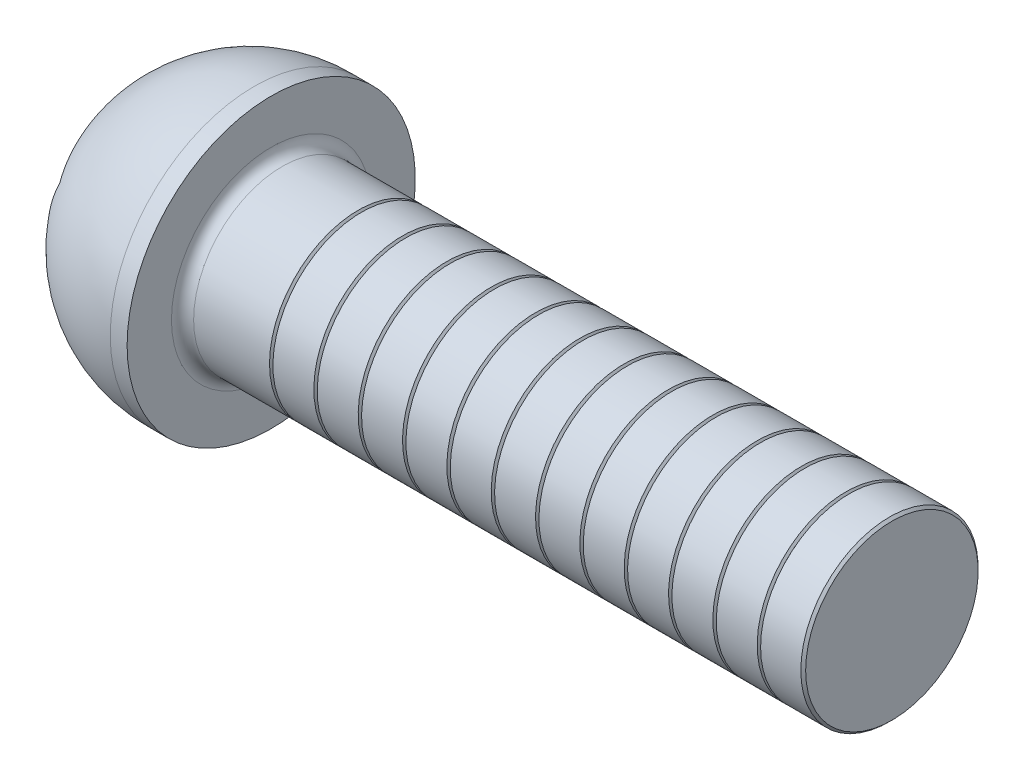
ISO-10303-21;
HEADER;
FILE_DESCRIPTION(('STEP AP214'),'2;1');
FILE_NAME('part.step','',(''),(''),'','','');
FILE_SCHEMA(('AUTOMOTIVE_DESIGN { 1 0 10303 214 1 1 1 1 }'));
ENDSEC;
DATA;
#1=APPLICATION_CONTEXT('core data for automotive mechanical design processes');
#2=APPLICATION_PROTOCOL_DEFINITION('international standard','automotive_design',2000,#1);
#3=PRODUCT_CONTEXT('',#1,'mechanical');
#4=PRODUCT('Part','Part','',(#3));
#5=PRODUCT_RELATED_PRODUCT_CATEGORY('part','',(#4));
#6=PRODUCT_DEFINITION_FORMATION('','',#4);
#7=PRODUCT_DEFINITION_CONTEXT('part definition',#1,'design');
#8=PRODUCT_DEFINITION('design','',#6,#7);
#9=PRODUCT_DEFINITION_SHAPE('','',#8);
#10=(LENGTH_UNIT() NAMED_UNIT(*) SI_UNIT(.MILLI.,.METRE.));
#11=(NAMED_UNIT(*) PLANE_ANGLE_UNIT() SI_UNIT($,.RADIAN.));
#12=(NAMED_UNIT(*) SI_UNIT($,.STERADIAN.) SOLID_ANGLE_UNIT());
#13=UNCERTAINTY_MEASURE_WITH_UNIT(LENGTH_MEASURE(1.E-05),#10,'distance_accuracy_value','');
#14=(GEOMETRIC_REPRESENTATION_CONTEXT(3) GLOBAL_UNCERTAINTY_ASSIGNED_CONTEXT((#13)) GLOBAL_UNIT_ASSIGNED_CONTEXT((#10,
#11,#12)) REPRESENTATION_CONTEXT('',''));
#15=CARTESIAN_POINT('',(0.,0.,0.));
#16=DIRECTION('',(0.,0.,1.));
#17=DIRECTION('',(1.,0.,0.));
#18=AXIS2_PLACEMENT_3D('',#15,#16,#17);
#19=CARTESIAN_POINT('',(2.81648544520552,0.,0.));
#20=DIRECTION('',(-1.,0.,0.));
#21=DIRECTION('',(0.,1.,0.));
#22=AXIS2_PLACEMENT_3D('',#19,#20,#21);
#23=SPHERICAL_SURFACE('',#22,3.25164808413431);
#24=CARTESIAN_POINT('',(2.92000000000003,0.,0.));
#25=DIRECTION('',(-1.,0.,0.));
#26=DIRECTION('',(0.,0.,1.));
#27=AXIS2_PLACEMENT_3D('',#24,#25,#26);
#28=CIRCLE('',#27,3.25);
#29=CARTESIAN_POINT('',(2.92000000000003,0.,3.25));
#30=VERTEX_POINT('',#29);
#31=EDGE_CURVE('E181',#30,#30,#28,.T.);
#32=ORIENTED_EDGE('',*,*,#31,.T.);
#33=EDGE_LOOP('',(#32));
#34=FACE_BOUND('',#33,.T.);
#35=CARTESIAN_POINT('',(2.81648544520552,-1.73205080756889,-0.99999999999989));
#36=DIRECTION('',(0.,0.866025403784439,0.500000000000001));
#37=DIRECTION('',(0.,-0.499999999999999,0.866025403784439));
#38=AXIS2_PLACEMENT_3D('',#35,#36,#37);
#39=CIRCLE('',#38,2.56382824367279);
#40=CARTESIAN_POINT('',(0.527406606519287,-2.30940107675837,3.33066907387547E-13));
#41=VERTEX_POINT('',#40);
#42=CARTESIAN_POINT('',(0.527406606519287,-1.15470053837918,-1.99999999999972));
#43=VERTEX_POINT('',#42);
#44=EDGE_CURVE('E145',#41,#43,#39,.F.);
#45=ORIENTED_EDGE('',*,*,#44,.T.);
#46=CARTESIAN_POINT('',(2.81648544520552,0.,-1.99999999999989));
#47=DIRECTION('',(0.,0.,1.));
#48=DIRECTION('',(0.,-1.,0.));
#49=AXIS2_PLACEMENT_3D('',#46,#47,#48);
#50=CIRCLE('',#49,2.56382824367279);
#51=CARTESIAN_POINT('',(0.527406606519287,1.15470053837941,-1.99999999999967));
#52=VERTEX_POINT('',#51);
#53=EDGE_CURVE('E161',#43,#52,#50,.F.);
#54=ORIENTED_EDGE('',*,*,#53,.T.);
#55=CARTESIAN_POINT('',(2.81648544520552,1.73205080756889,-0.99999999999989));
#56=DIRECTION('',(0.,-0.866025403784438,0.5));
#57=DIRECTION('',(0.,-0.500000000000001,-0.86602540378444));
#58=AXIS2_PLACEMENT_3D('',#55,#56,#57);
#59=CIRCLE('',#58,2.56382824367279);
#60=CARTESIAN_POINT('',(0.527406606519287,2.30940107675848,0.));
#61=VERTEX_POINT('',#60);
#62=EDGE_CURVE('E158',#52,#61,#59,.F.);
#63=ORIENTED_EDGE('',*,*,#62,.T.);
#64=CARTESIAN_POINT('',(2.81648544520552,1.73205080756889,1.00000000000028));
#65=DIRECTION('',(0.,-0.866025403784439,-0.500000000000001));
#66=DIRECTION('',(0.,0.5,-0.866025403784439));
#67=AXIS2_PLACEMENT_3D('',#64,#65,#66);
#68=CIRCLE('',#67,2.56382824367279);
#69=CARTESIAN_POINT('',(0.527406606519287,1.15470053837929,2.00000000000006));
#70=VERTEX_POINT('',#69);
#71=EDGE_CURVE('E150',#61,#70,#68,.F.);
#72=ORIENTED_EDGE('',*,*,#71,.T.);
#73=CARTESIAN_POINT('',(2.81648544520552,0.,2.));
#74=DIRECTION('',(0.,0.,-1.));
#75=DIRECTION('',(0.,1.,0.));
#76=AXIS2_PLACEMENT_3D('',#73,#74,#75);
#77=CIRCLE('',#76,2.56382824367279);
#78=CARTESIAN_POINT('',(0.527406606519287,-1.15470053837918,2.00000000000033));
#79=VERTEX_POINT('',#78);
#80=EDGE_CURVE('E146',#70,#79,#77,.F.);
#81=ORIENTED_EDGE('',*,*,#80,.T.);
#82=CARTESIAN_POINT('',(2.81648544520552,-1.73205080756889,1.00000000000028));
#83=DIRECTION('',(0.,0.866025403784439,-0.5));
#84=DIRECTION('',(0.,0.500000000000001,0.866025403784439));
#85=AXIS2_PLACEMENT_3D('',#82,#83,#84);
#86=CIRCLE('',#85,2.56382824367279);
#87=EDGE_CURVE('E165',#79,#41,#86,.F.);
#88=ORIENTED_EDGE('',*,*,#87,.T.);
#89=EDGE_LOOP('',(#45,#54,#63,#72,#81,#88));
#90=FACE_BOUND('',#89,.T.);
#91=ADVANCED_FACE('F51',(#34,#90),#23,.T.);
#92=CARTESIAN_POINT('',(0.,0.,0.));
#93=DIRECTION('',(-1.,0.,0.));
#94=DIRECTION('',(0.,0.,1.));
#95=AXIS2_PLACEMENT_3D('',#92,#93,#94);
#96=CYLINDRICAL_SURFACE('',#95,3.25);
#97=ORIENTED_EDGE('',*,*,#31,.F.);
#98=EDGE_LOOP('',(#97));
#99=FACE_BOUND('',#98,.T.);
#100=CARTESIAN_POINT('',(3.29999999999997,0.,0.));
#101=DIRECTION('',(-1.,0.,0.));
#102=DIRECTION('',(0.,0.,1.));
#103=AXIS2_PLACEMENT_3D('',#100,#101,#102);
#104=CIRCLE('',#103,3.25);
#105=CARTESIAN_POINT('',(3.29999999999997,0.,3.25));
#106=VERTEX_POINT('',#105);
#107=EDGE_CURVE('E178',#106,#106,#104,.T.);
#108=ORIENTED_EDGE('',*,*,#107,.T.);
#109=EDGE_LOOP('',(#108));
#110=FACE_BOUND('',#109,.T.);
#111=ADVANCED_FACE('F203',(#99,#110),#96,.T.);
#112=CARTESIAN_POINT('',(3.29999999999997,2.,0.));
#113=DIRECTION('',(-1.,0.,0.));
#114=DIRECTION('',(0.,0.,1.));
#115=AXIS2_PLACEMENT_3D('',#112,#113,#114);
#116=PLANE('',#115);
#117=CARTESIAN_POINT('',(3.29999999999997,0.,0.));
#118=DIRECTION('',(-1.,0.,0.));
#119=DIRECTION('',(0.,0.,1.));
#120=AXIS2_PLACEMENT_3D('',#117,#118,#119);
#121=CIRCLE('',#120,2.25);
#122=CARTESIAN_POINT('',(3.29999999999997,0.,2.25));
#123=VERTEX_POINT('',#122);
#124=EDGE_CURVE('E59',#123,#123,#121,.T.);
#125=ORIENTED_EDGE('',*,*,#124,.T.);
#126=EDGE_LOOP('',(#125));
#127=FACE_BOUND('',#126,.T.);
#128=ORIENTED_EDGE('',*,*,#107,.F.);
#129=EDGE_LOOP('',(#128));
#130=FACE_BOUND('',#129,.T.);
#131=ADVANCED_FACE('F186',(#127,#130),#116,.F.);
#132=CARTESIAN_POINT('',(0.,0.,0.));
#133=DIRECTION('',(-1.,0.,0.));
#134=DIRECTION('',(0.,0.,1.));
#135=AXIS2_PLACEMENT_3D('',#132,#133,#134);
#136=CYLINDRICAL_SURFACE('',#135,2.);
#137=CARTESIAN_POINT('',(5.26183868916752,0.,0.));
#138=DIRECTION('',(-1.,0.,0.));
#139=DIRECTION('',(0.,-1.,0.));
#140=AXIS2_PLACEMENT_3D('',#137,#138,#139);
#141=CIRCLE('',#140,2.);
#142=CARTESIAN_POINT('',(5.26183868916752,-2.,0.));
#143=VERTEX_POINT('',#142);
#144=EDGE_CURVE('E462',#143,#143,#141,.T.);
#145=ORIENTED_EDGE('',*,*,#144,.T.);
#146=EDGE_LOOP('',(#145));
#147=FACE_BOUND('',#146,.T.);
#148=CARTESIAN_POINT('',(3.55000000000005,0.,0.));
#149=DIRECTION('',(-1.,0.,0.));
#150=DIRECTION('',(0.,0.,1.));
#151=AXIS2_PLACEMENT_3D('',#148,#149,#150);
#152=CIRCLE('',#151,2.);
#153=CARTESIAN_POINT('',(3.55000000000005,0.,2.));
#154=VERTEX_POINT('',#153);
#155=EDGE_CURVE('E13',#154,#154,#152,.F.);
#156=ORIENTED_EDGE('',*,*,#155,.T.);
#157=EDGE_LOOP('',(#156));
#158=FACE_BOUND('',#157,.T.);
#159=ADVANCED_FACE('F190',(#147,#158),#136,.T.);
#160=CARTESIAN_POINT('',(3.55000000000005,0.,0.));
#161=DIRECTION('',(-1.,0.,0.));
#162=DIRECTION('',(0.,0.,1.));
#163=AXIS2_PLACEMENT_3D('',#160,#161,#162);
#164=TOROIDAL_SURFACE('',#163,2.25,0.25);
#165=ORIENTED_EDGE('',*,*,#155,.F.);
#166=EDGE_LOOP('',(#165));
#167=FACE_BOUND('',#166,.T.);
#168=ORIENTED_EDGE('',*,*,#124,.F.);
#169=EDGE_LOOP('',(#168));
#170=FACE_BOUND('',#169,.T.);
#171=ADVANCED_FACE('F53',(#167,#170),#164,.F.);
#172=CARTESIAN_POINT('',(2.07999999999997,-2.30940107675837,3.33066907387547E-13));
#173=DIRECTION('',(0.,0.866025403784439,-0.5));
#174=DIRECTION('',(0.,0.500000000000001,0.866025403784439));
#175=AXIS2_PLACEMENT_3D('',#172,#173,#174);
#176=PLANE('',#175);
#177=ORIENTED_EDGE('',*,*,#87,.F.);
#178=DIRECTION('',(-1.,0.,0.));
#179=VECTOR('',#178,1.);
#180=CARTESIAN_POINT('',(2.07999999999997,-1.15470053837918,2.00000000000033));
#181=LINE('',#180,#179);
#182=CARTESIAN_POINT('',(2.07999999999997,-1.15470053837918,2.00000000000033));
#183=VERTEX_POINT('',#182);
#184=EDGE_CURVE('E482',#183,#79,#181,.T.);
#185=ORIENTED_EDGE('',*,*,#184,.F.);
#186=DIRECTION('',(0.,-0.500000000000001,-0.866025403784439));
#187=VECTOR('',#186,1.);
#188=CARTESIAN_POINT('',(2.07999999999997,-2.30940107675837,3.33066907387547E-13));
#189=LINE('',#188,#187);
#190=CARTESIAN_POINT('',(2.07999999999997,-1.73205080756889,1.00000000000028));
#191=VERTEX_POINT('',#190);
#192=EDGE_CURVE('E130',#183,#191,#189,.T.);
#193=ORIENTED_EDGE('',*,*,#192,.T.);
#194=CARTESIAN_POINT('',(2.07999999999997,-2.30940107675837,3.33066907387547E-13));
#195=VERTEX_POINT('',#194);
#196=EDGE_CURVE('E124',#191,#195,#189,.T.);
#197=ORIENTED_EDGE('',*,*,#196,.T.);
#198=DIRECTION('',(-1.,0.,0.));
#199=VECTOR('',#198,1.);
#200=CARTESIAN_POINT('',(2.07999999999997,-2.30940107675837,3.33066907387547E-13));
#201=LINE('',#200,#199);
#202=EDGE_CURVE('E126',#195,#41,#201,.T.);
#203=ORIENTED_EDGE('',*,*,#202,.T.);
#204=EDGE_LOOP('',(#177,#185,#193,#197,#203));
#205=FACE_BOUND('',#204,.T.);
#206=ADVANCED_FACE('F125',(#205),#176,.T.);
#207=CARTESIAN_POINT('',(2.07999999999997,-1.15470053837918,-1.99999999999972));
#208=DIRECTION('',(0.,0.866025403784439,0.500000000000001));
#209=DIRECTION('',(0.,-0.499999999999999,0.866025403784439));
#210=AXIS2_PLACEMENT_3D('',#207,#208,#209);
#211=PLANE('',#210);
#212=ORIENTED_EDGE('',*,*,#44,.F.);
#213=ORIENTED_EDGE('',*,*,#202,.F.);
#214=DIRECTION('',(0.,0.499999999999999,-0.866025403784439));
#215=VECTOR('',#214,1.);
#216=CARTESIAN_POINT('',(2.07999999999997,-1.15470053837918,-1.99999999999972));
#217=LINE('',#216,#215);
#218=CARTESIAN_POINT('',(2.07999999999997,-1.73205080756889,-0.99999999999989));
#219=VERTEX_POINT('',#218);
#220=EDGE_CURVE('E66',#195,#219,#217,.T.);
#221=ORIENTED_EDGE('',*,*,#220,.T.);
#222=CARTESIAN_POINT('',(2.07999999999997,-1.15470053837918,-1.99999999999972));
#223=VERTEX_POINT('',#222);
#224=EDGE_CURVE('E140',#219,#223,#217,.T.);
#225=ORIENTED_EDGE('',*,*,#224,.T.);
#226=DIRECTION('',(-1.,0.,0.));
#227=VECTOR('',#226,1.);
#228=CARTESIAN_POINT('',(2.07999999999997,-1.15470053837918,-1.99999999999972));
#229=LINE('',#228,#227);
#230=EDGE_CURVE('E147',#223,#43,#229,.T.);
#231=ORIENTED_EDGE('',*,*,#230,.T.);
#232=EDGE_LOOP('',(#212,#213,#221,#225,#231));
#233=FACE_BOUND('',#232,.T.);
#234=ADVANCED_FACE('F142',(#233),#211,.T.);
#235=CARTESIAN_POINT('',(2.07999999999997,1.15470053837941,-1.99999999999967));
#236=DIRECTION('',(0.,0.,1.));
#237=DIRECTION('',(0.,-1.,0.));
#238=AXIS2_PLACEMENT_3D('',#235,#236,#237);
#239=PLANE('',#238);
#240=ORIENTED_EDGE('',*,*,#53,.F.);
#241=ORIENTED_EDGE('',*,*,#230,.F.);
#242=DIRECTION('',(0.,1.,0.));
#243=VECTOR('',#242,1.);
#244=CARTESIAN_POINT('',(2.07999999999997,1.15470053837941,-1.99999999999967));
#245=LINE('',#244,#243);
#246=CARTESIAN_POINT('',(2.07999999999997,0.,-1.99999999999989));
#247=VERTEX_POINT('',#246);
#248=EDGE_CURVE('E467',#223,#247,#245,.T.);
#249=ORIENTED_EDGE('',*,*,#248,.T.);
#250=CARTESIAN_POINT('',(2.07999999999997,1.15470053837941,-1.99999999999967));
#251=VERTEX_POINT('',#250);
#252=EDGE_CURVE('E139',#247,#251,#245,.T.);
#253=ORIENTED_EDGE('',*,*,#252,.T.);
#254=DIRECTION('',(-1.,0.,0.));
#255=VECTOR('',#254,1.);
#256=CARTESIAN_POINT('',(2.07999999999997,1.15470053837941,-1.99999999999967));
#257=LINE('',#256,#255);
#258=EDGE_CURVE('E152',#251,#52,#257,.T.);
#259=ORIENTED_EDGE('',*,*,#258,.T.);
#260=EDGE_LOOP('',(#240,#241,#249,#253,#259));
#261=FACE_BOUND('',#260,.T.);
#262=ADVANCED_FACE('F231',(#261),#239,.T.);
#263=CARTESIAN_POINT('',(2.07999999999997,2.30940107675848,0.));
#264=DIRECTION('',(0.,-0.866025403784438,0.5));
#265=DIRECTION('',(0.,-0.500000000000001,-0.86602540378444));
#266=AXIS2_PLACEMENT_3D('',#263,#264,#265);
#267=PLANE('',#266);
#268=ORIENTED_EDGE('',*,*,#62,.F.);
#269=ORIENTED_EDGE('',*,*,#258,.F.);
#270=DIRECTION('',(0.,0.500000000000001,0.866025403784439));
#271=VECTOR('',#270,1.);
#272=CARTESIAN_POINT('',(2.07999999999997,2.30940107675848,0.));
#273=LINE('',#272,#271);
#274=CARTESIAN_POINT('',(2.07999999999997,1.73205080756889,-0.99999999999989));
#275=VERTEX_POINT('',#274);
#276=EDGE_CURVE('E471',#251,#275,#273,.T.);
#277=ORIENTED_EDGE('',*,*,#276,.T.);
#278=CARTESIAN_POINT('',(2.07999999999997,2.30940107675848,0.));
#279=VERTEX_POINT('',#278);
#280=EDGE_CURVE('E470',#275,#279,#273,.T.);
#281=ORIENTED_EDGE('',*,*,#280,.T.);
#282=DIRECTION('',(-1.,0.,0.));
#283=VECTOR('',#282,1.);
#284=CARTESIAN_POINT('',(2.07999999999997,2.30940107675848,0.));
#285=LINE('',#284,#283);
#286=EDGE_CURVE('E488',#279,#61,#285,.T.);
#287=ORIENTED_EDGE('',*,*,#286,.T.);
#288=EDGE_LOOP('',(#268,#269,#277,#281,#287));
#289=FACE_BOUND('',#288,.T.);
#290=ADVANCED_FACE('F234',(#289),#267,.T.);
#291=CARTESIAN_POINT('',(2.07999999999997,1.15470053837929,2.00000000000006));
#292=DIRECTION('',(0.,-0.866025403784439,-0.500000000000001));
#293=DIRECTION('',(0.,0.5,-0.866025403784439));
#294=AXIS2_PLACEMENT_3D('',#291,#292,#293);
#295=PLANE('',#294);
#296=ORIENTED_EDGE('',*,*,#71,.F.);
#297=ORIENTED_EDGE('',*,*,#286,.F.);
#298=DIRECTION('',(0.,-0.5,0.866025403784439));
#299=VECTOR('',#298,1.);
#300=CARTESIAN_POINT('',(2.07999999999997,1.15470053837929,2.00000000000006));
#301=LINE('',#300,#299);
#302=CARTESIAN_POINT('',(2.07999999999997,1.73205080756889,1.00000000000028));
#303=VERTEX_POINT('',#302);
#304=EDGE_CURVE('E475',#279,#303,#301,.T.);
#305=ORIENTED_EDGE('',*,*,#304,.T.);
#306=CARTESIAN_POINT('',(2.07999999999997,1.15470053837929,2.00000000000006));
#307=VERTEX_POINT('',#306);
#308=EDGE_CURVE('E474',#303,#307,#301,.T.);
#309=ORIENTED_EDGE('',*,*,#308,.T.);
#310=DIRECTION('',(-1.,0.,0.));
#311=VECTOR('',#310,1.);
#312=CARTESIAN_POINT('',(2.07999999999997,1.15470053837929,2.00000000000006));
#313=LINE('',#312,#311);
#314=EDGE_CURVE('E485',#307,#70,#313,.T.);
#315=ORIENTED_EDGE('',*,*,#314,.T.);
#316=EDGE_LOOP('',(#296,#297,#305,#309,#315));
#317=FACE_BOUND('',#316,.T.);
#318=ADVANCED_FACE('F238',(#317),#295,.T.);
#319=CARTESIAN_POINT('',(2.07999999999997,-1.15470053837918,2.00000000000033));
#320=DIRECTION('',(0.,0.,-1.));
#321=DIRECTION('',(0.,1.,0.));
#322=AXIS2_PLACEMENT_3D('',#319,#320,#321);
#323=PLANE('',#322);
#324=ORIENTED_EDGE('',*,*,#80,.F.);
#325=ORIENTED_EDGE('',*,*,#314,.F.);
#326=DIRECTION('',(0.,-1.,0.));
#327=VECTOR('',#326,1.);
#328=CARTESIAN_POINT('',(2.07999999999997,-1.15470053837918,2.00000000000033));
#329=LINE('',#328,#327);
#330=CARTESIAN_POINT('',(2.07999999999997,0.,2.));
#331=VERTEX_POINT('',#330);
#332=EDGE_CURVE('E479',#307,#331,#329,.T.);
#333=ORIENTED_EDGE('',*,*,#332,.T.);
#334=EDGE_CURVE('E478',#331,#183,#329,.T.);
#335=ORIENTED_EDGE('',*,*,#334,.T.);
#336=ORIENTED_EDGE('',*,*,#184,.T.);
#337=EDGE_LOOP('',(#324,#325,#333,#335,#336));
#338=FACE_BOUND('',#337,.T.);
#339=ADVANCED_FACE('F242',(#338),#323,.T.);
#340=CARTESIAN_POINT('',(2.07999999999997,-3.46410161513777,-1.99999999999972));
#341=DIRECTION('',(1.,0.,0.));
#342=DIRECTION('',(0.,0.,-1.));
#343=AXIS2_PLACEMENT_3D('',#340,#341,#342);
#344=PLANE('',#343);
#345=CARTESIAN_POINT('',(2.07999999999997,0.,0.));
#346=DIRECTION('',(-1.,0.,0.));
#347=DIRECTION('',(0.,0.,1.));
#348=AXIS2_PLACEMENT_3D('',#345,#346,#347);
#349=CIRCLE('',#348,2.);
#350=EDGE_CURVE('E502',#275,#247,#349,.T.);
#351=ORIENTED_EDGE('',*,*,#350,.F.);
#352=ORIENTED_EDGE('',*,*,#276,.F.);
#353=ORIENTED_EDGE('',*,*,#252,.F.);
#354=EDGE_LOOP('',(#351,#352,#353));
#355=FACE_BOUND('',#354,.T.);
#356=ADVANCED_FACE('F246',(#355),#344,.F.);
#357=EDGE_CURVE('E172',#303,#275,#349,.T.);
#358=ORIENTED_EDGE('',*,*,#357,.F.);
#359=ORIENTED_EDGE('',*,*,#304,.F.);
#360=ORIENTED_EDGE('',*,*,#280,.F.);
#361=EDGE_LOOP('',(#358,#359,#360));
#362=FACE_BOUND('',#361,.T.);
#363=ADVANCED_FACE('F509',(#362),#344,.F.);
#364=EDGE_CURVE('E168',#331,#303,#349,.T.);
#365=ORIENTED_EDGE('',*,*,#364,.F.);
#366=ORIENTED_EDGE('',*,*,#332,.F.);
#367=ORIENTED_EDGE('',*,*,#308,.F.);
#368=EDGE_LOOP('',(#365,#366,#367));
#369=FACE_BOUND('',#368,.T.);
#370=ADVANCED_FACE('F511',(#369),#344,.F.);
#371=EDGE_CURVE('E167',#191,#331,#349,.T.);
#372=ORIENTED_EDGE('',*,*,#371,.F.);
#373=ORIENTED_EDGE('',*,*,#192,.F.);
#374=ORIENTED_EDGE('',*,*,#334,.F.);
#375=EDGE_LOOP('',(#372,#373,#374));
#376=FACE_BOUND('',#375,.T.);
#377=ADVANCED_FACE('F500',(#376),#344,.F.);
#378=EDGE_CURVE('E137',#219,#191,#349,.T.);
#379=ORIENTED_EDGE('',*,*,#378,.F.);
#380=ORIENTED_EDGE('',*,*,#220,.F.);
#381=ORIENTED_EDGE('',*,*,#196,.F.);
#382=EDGE_LOOP('',(#379,#380,#381));
#383=FACE_BOUND('',#382,.T.);
#384=ADVANCED_FACE('F136',(#383),#344,.F.);
#385=EDGE_CURVE('E501',#247,#219,#349,.T.);
#386=ORIENTED_EDGE('',*,*,#385,.F.);
#387=ORIENTED_EDGE('',*,*,#248,.F.);
#388=ORIENTED_EDGE('',*,*,#224,.F.);
#389=EDGE_LOOP('',(#386,#387,#388));
#390=FACE_BOUND('',#389,.T.);
#391=ADVANCED_FACE('F226',(#390),#344,.F.);
#392=CARTESIAN_POINT('',(3.23470053837926,0.,0.));
#393=DIRECTION('',(-1.,0.,0.));
#394=DIRECTION('',(0.,0.,1.));
#395=AXIS2_PLACEMENT_3D('',#392,#393,#394);
#396=CONICAL_SURFACE('',#395,0.,1.04719755119659);
#397=ORIENTED_EDGE('',*,*,#364,.T.);
#398=ORIENTED_EDGE('',*,*,#357,.T.);
#399=ORIENTED_EDGE('',*,*,#350,.T.);
#400=ORIENTED_EDGE('',*,*,#385,.T.);
#401=ORIENTED_EDGE('',*,*,#378,.T.);
#402=ORIENTED_EDGE('',*,*,#371,.T.);
#403=EDGE_LOOP('',(#397,#398,#399,#400,#401,#402));
#404=FACE_BOUND('',#403,.T.);
#405=CARTESIAN_POINT('',(3.23470053837926,0.,0.));
#406=VERTEX_POINT('',#405);
#407=VERTEX_LOOP('',#406);
#408=FACE_BOUND('',#407,.T.);
#409=ADVANCED_FACE('F223',(#404,#408),#396,.F.);
#410=CARTESIAN_POINT('',(5.33816131083242,0.,0.));
#411=DIRECTION('',(1.,0.,0.));
#412=DIRECTION('',(0.,1.,0.));
#413=AXIS2_PLACEMENT_3D('',#410,#411,#412);
#414=CONICAL_SURFACE('',#413,2.,0.959931088596876);
#415=CARTESIAN_POINT('',(5.29999999999997,0.,0.));
#416=DIRECTION('',(-1.,0.,0.));
#417=DIRECTION('',(0.,-1.,0.));
#418=AXIS2_PLACEMENT_3D('',#415,#416,#417);
#419=CIRCLE('',#418,1.9455);
#420=CARTESIAN_POINT('',(5.29999999999997,-1.9455,0.));
#421=VERTEX_POINT('',#420);
#422=EDGE_CURVE('E459',#421,#421,#419,.T.);
#423=ORIENTED_EDGE('',*,*,#422,.F.);
#424=EDGE_LOOP('',(#423));
#425=FACE_BOUND('',#424,.T.);
#426=CARTESIAN_POINT('',(5.33816131083242,0.,0.));
#427=DIRECTION('',(-1.,0.,0.));
#428=DIRECTION('',(0.,-1.,0.));
#429=AXIS2_PLACEMENT_3D('',#426,#427,#428);
#430=CIRCLE('',#429,2.);
#431=CARTESIAN_POINT('',(5.33816131083242,-2.,0.));
#432=VERTEX_POINT('',#431);
#433=EDGE_CURVE('E134',#432,#432,#430,.T.);
#434=ORIENTED_EDGE('',*,*,#433,.T.);
#435=EDGE_LOOP('',(#434));
#436=FACE_BOUND('',#435,.T.);
#437=ADVANCED_FACE('F225',(#425,#436),#414,.T.);
#438=CARTESIAN_POINT('',(5.29999999999997,0.,0.));
#439=DIRECTION('',(-1.,0.,0.));
#440=DIRECTION('',(0.,-1.,0.));
#441=AXIS2_PLACEMENT_3D('',#438,#439,#440);
#442=CONICAL_SURFACE('',#441,1.9455,0.959931088596898);
#443=ORIENTED_EDGE('',*,*,#144,.F.);
#444=EDGE_LOOP('',(#443));
#445=FACE_BOUND('',#444,.T.);
#446=ORIENTED_EDGE('',*,*,#422,.T.);
#447=EDGE_LOOP('',(#446));
#448=FACE_BOUND('',#447,.T.);
#449=ADVANCED_FACE('F253',(#445,#448),#442,.T.);
#450=CARTESIAN_POINT('',(6.26183868916752,0.,0.));
#451=DIRECTION('',(-1.,0.,0.));
#452=DIRECTION('',(0.,-1.,0.));
#453=AXIS2_PLACEMENT_3D('',#450,#451,#452);
#454=CIRCLE('',#453,2.);
#455=CARTESIAN_POINT('',(6.26183868916752,-2.,0.));
#456=VERTEX_POINT('',#455);
#457=EDGE_CURVE('E453',#456,#456,#454,.T.);
#458=ORIENTED_EDGE('',*,*,#457,.T.);
#459=EDGE_LOOP('',(#458));
#460=FACE_BOUND('',#459,.T.);
#461=ORIENTED_EDGE('',*,*,#433,.F.);
#462=EDGE_LOOP('',(#461));
#463=FACE_BOUND('',#462,.T.);
#464=ADVANCED_FACE('F200',(#460,#463),#136,.T.);
#465=CARTESIAN_POINT('',(6.33816131083242,0.,0.));
#466=DIRECTION('',(1.,0.,0.));
#467=DIRECTION('',(0.,1.,0.));
#468=AXIS2_PLACEMENT_3D('',#465,#466,#467);
#469=CONICAL_SURFACE('',#468,2.,0.959931088596876);
#470=CARTESIAN_POINT('',(6.29999999999997,0.,0.));
#471=DIRECTION('',(-1.,0.,0.));
#472=DIRECTION('',(0.,-1.,0.));
#473=AXIS2_PLACEMENT_3D('',#470,#471,#472);
#474=CIRCLE('',#473,1.9455);
#475=CARTESIAN_POINT('',(6.29999999999997,-1.9455,0.));
#476=VERTEX_POINT('',#475);
#477=EDGE_CURVE('E450',#476,#476,#474,.T.);
#478=ORIENTED_EDGE('',*,*,#477,.F.);
#479=EDGE_LOOP('',(#478));
#480=FACE_BOUND('',#479,.T.);
#481=CARTESIAN_POINT('',(6.33816131083242,0.,0.));
#482=DIRECTION('',(-1.,0.,0.));
#483=DIRECTION('',(0.,-1.,0.));
#484=AXIS2_PLACEMENT_3D('',#481,#482,#483);
#485=CIRCLE('',#484,2.);
#486=CARTESIAN_POINT('',(6.33816131083242,-2.,0.));
#487=VERTEX_POINT('',#486);
#488=EDGE_CURVE('E456',#487,#487,#485,.T.);
#489=ORIENTED_EDGE('',*,*,#488,.T.);
#490=EDGE_LOOP('',(#489));
#491=FACE_BOUND('',#490,.T.);
#492=ADVANCED_FACE('F258',(#480,#491),#469,.T.);
#493=CARTESIAN_POINT('',(6.29999999999997,0.,0.));
#494=DIRECTION('',(-1.,0.,0.));
#495=DIRECTION('',(0.,-1.,0.));
#496=AXIS2_PLACEMENT_3D('',#493,#494,#495);
#497=CONICAL_SURFACE('',#496,1.9455,0.959931088596898);
#498=ORIENTED_EDGE('',*,*,#457,.F.);
#499=EDGE_LOOP('',(#498));
#500=FACE_BOUND('',#499,.T.);
#501=ORIENTED_EDGE('',*,*,#477,.T.);
#502=EDGE_LOOP('',(#501));
#503=FACE_BOUND('',#502,.T.);
#504=ADVANCED_FACE('F261',(#500,#503),#497,.T.);
#505=CARTESIAN_POINT('',(7.26183868916752,0.,0.));
#506=DIRECTION('',(-1.,0.,0.));
#507=DIRECTION('',(0.,-1.,0.));
#508=AXIS2_PLACEMENT_3D('',#505,#506,#507);
#509=CIRCLE('',#508,2.);
#510=CARTESIAN_POINT('',(7.26183868916752,-2.,0.));
#511=VERTEX_POINT('',#510);
#512=EDGE_CURVE('E444',#511,#511,#509,.T.);
#513=ORIENTED_EDGE('',*,*,#512,.T.);
#514=EDGE_LOOP('',(#513));
#515=FACE_BOUND('',#514,.T.);
#516=ORIENTED_EDGE('',*,*,#488,.F.);
#517=EDGE_LOOP('',(#516));
#518=FACE_BOUND('',#517,.T.);
#519=ADVANCED_FACE('F265',(#515,#518),#136,.T.);
#520=CARTESIAN_POINT('',(7.33816131083243,0.,0.));
#521=DIRECTION('',(1.,0.,0.));
#522=DIRECTION('',(0.,1.,0.));
#523=AXIS2_PLACEMENT_3D('',#520,#521,#522);
#524=CONICAL_SURFACE('',#523,2.,0.959931088596876);
#525=CARTESIAN_POINT('',(7.29999999999997,0.,0.));
#526=DIRECTION('',(-1.,0.,0.));
#527=DIRECTION('',(0.,-1.,0.));
#528=AXIS2_PLACEMENT_3D('',#525,#526,#527);
#529=CIRCLE('',#528,1.9455);
#530=CARTESIAN_POINT('',(7.29999999999997,-1.9455,0.));
#531=VERTEX_POINT('',#530);
#532=EDGE_CURVE('E441',#531,#531,#529,.T.);
#533=ORIENTED_EDGE('',*,*,#532,.F.);
#534=EDGE_LOOP('',(#533));
#535=FACE_BOUND('',#534,.T.);
#536=CARTESIAN_POINT('',(7.33816131083243,0.,0.));
#537=DIRECTION('',(-1.,0.,0.));
#538=DIRECTION('',(0.,-1.,0.));
#539=AXIS2_PLACEMENT_3D('',#536,#537,#538);
#540=CIRCLE('',#539,2.);
#541=CARTESIAN_POINT('',(7.33816131083243,-2.,0.));
#542=VERTEX_POINT('',#541);
#543=EDGE_CURVE('E447',#542,#542,#540,.T.);
#544=ORIENTED_EDGE('',*,*,#543,.T.);
#545=EDGE_LOOP('',(#544));
#546=FACE_BOUND('',#545,.T.);
#547=ADVANCED_FACE('F267',(#535,#546),#524,.T.);
#548=CARTESIAN_POINT('',(7.29999999999997,0.,0.));
#549=DIRECTION('',(-1.,0.,0.));
#550=DIRECTION('',(0.,-1.,0.));
#551=AXIS2_PLACEMENT_3D('',#548,#549,#550);
#552=CONICAL_SURFACE('',#551,1.9455,0.959931088596898);
#553=ORIENTED_EDGE('',*,*,#512,.F.);
#554=EDGE_LOOP('',(#553));
#555=FACE_BOUND('',#554,.T.);
#556=ORIENTED_EDGE('',*,*,#532,.T.);
#557=EDGE_LOOP('',(#556));
#558=FACE_BOUND('',#557,.T.);
#559=ADVANCED_FACE('F270',(#555,#558),#552,.T.);
#560=CARTESIAN_POINT('',(8.26183868916752,0.,0.));
#561=DIRECTION('',(-1.,0.,0.));
#562=DIRECTION('',(0.,-1.,0.));
#563=AXIS2_PLACEMENT_3D('',#560,#561,#562);
#564=CIRCLE('',#563,2.);
#565=CARTESIAN_POINT('',(8.26183868916752,-2.,0.));
#566=VERTEX_POINT('',#565);
#567=EDGE_CURVE('E435',#566,#566,#564,.T.);
#568=ORIENTED_EDGE('',*,*,#567,.T.);
#569=EDGE_LOOP('',(#568));
#570=FACE_BOUND('',#569,.T.);
#571=ORIENTED_EDGE('',*,*,#543,.F.);
#572=EDGE_LOOP('',(#571));
#573=FACE_BOUND('',#572,.T.);
#574=ADVANCED_FACE('F274',(#570,#573),#136,.T.);
#575=CARTESIAN_POINT('',(8.33816131083243,0.,0.));
#576=DIRECTION('',(1.,0.,0.));
#577=DIRECTION('',(0.,1.,0.));
#578=AXIS2_PLACEMENT_3D('',#575,#576,#577);
#579=CONICAL_SURFACE('',#578,2.,0.959931088596876);
#580=CARTESIAN_POINT('',(8.29999999999997,0.,0.));
#581=DIRECTION('',(-1.,0.,0.));
#582=DIRECTION('',(0.,-1.,0.));
#583=AXIS2_PLACEMENT_3D('',#580,#581,#582);
#584=CIRCLE('',#583,1.9455);
#585=CARTESIAN_POINT('',(8.29999999999997,-1.9455,0.));
#586=VERTEX_POINT('',#585);
#587=EDGE_CURVE('E432',#586,#586,#584,.T.);
#588=ORIENTED_EDGE('',*,*,#587,.F.);
#589=EDGE_LOOP('',(#588));
#590=FACE_BOUND('',#589,.T.);
#591=CARTESIAN_POINT('',(8.33816131083243,0.,0.));
#592=DIRECTION('',(-1.,0.,0.));
#593=DIRECTION('',(0.,-1.,0.));
#594=AXIS2_PLACEMENT_3D('',#591,#592,#593);
#595=CIRCLE('',#594,2.);
#596=CARTESIAN_POINT('',(8.33816131083243,-2.,0.));
#597=VERTEX_POINT('',#596);
#598=EDGE_CURVE('E438',#597,#597,#595,.T.);
#599=ORIENTED_EDGE('',*,*,#598,.T.);
#600=EDGE_LOOP('',(#599));
#601=FACE_BOUND('',#600,.T.);
#602=ADVANCED_FACE('F276',(#590,#601),#579,.T.);
#603=CARTESIAN_POINT('',(8.29999999999997,0.,0.));
#604=DIRECTION('',(-1.,0.,0.));
#605=DIRECTION('',(0.,-1.,0.));
#606=AXIS2_PLACEMENT_3D('',#603,#604,#605);
#607=CONICAL_SURFACE('',#606,1.9455,0.959931088596898);
#608=ORIENTED_EDGE('',*,*,#567,.F.);
#609=EDGE_LOOP('',(#608));
#610=FACE_BOUND('',#609,.T.);
#611=ORIENTED_EDGE('',*,*,#587,.T.);
#612=EDGE_LOOP('',(#611));
#613=FACE_BOUND('',#612,.T.);
#614=ADVANCED_FACE('F279',(#610,#613),#607,.T.);
#615=CARTESIAN_POINT('',(9.26183868916752,0.,0.));
#616=DIRECTION('',(-1.,0.,0.));
#617=DIRECTION('',(0.,-1.,0.));
#618=AXIS2_PLACEMENT_3D('',#615,#616,#617);
#619=CIRCLE('',#618,2.);
#620=CARTESIAN_POINT('',(9.26183868916752,-2.,0.));
#621=VERTEX_POINT('',#620);
#622=EDGE_CURVE('E426',#621,#621,#619,.T.);
#623=ORIENTED_EDGE('',*,*,#622,.T.);
#624=EDGE_LOOP('',(#623));
#625=FACE_BOUND('',#624,.T.);
#626=ORIENTED_EDGE('',*,*,#598,.F.);
#627=EDGE_LOOP('',(#626));
#628=FACE_BOUND('',#627,.T.);
#629=ADVANCED_FACE('F283',(#625,#628),#136,.T.);
#630=CARTESIAN_POINT('',(9.33816131083243,0.,0.));
#631=DIRECTION('',(1.,0.,0.));
#632=DIRECTION('',(0.,1.,0.));
#633=AXIS2_PLACEMENT_3D('',#630,#631,#632);
#634=CONICAL_SURFACE('',#633,2.,0.959931088596876);
#635=CARTESIAN_POINT('',(9.29999999999998,0.,0.));
#636=DIRECTION('',(-1.,0.,0.));
#637=DIRECTION('',(0.,-1.,0.));
#638=AXIS2_PLACEMENT_3D('',#635,#636,#637);
#639=CIRCLE('',#638,1.9455);
#640=CARTESIAN_POINT('',(9.29999999999998,-1.9455,0.));
#641=VERTEX_POINT('',#640);
#642=EDGE_CURVE('E423',#641,#641,#639,.T.);
#643=ORIENTED_EDGE('',*,*,#642,.F.);
#644=EDGE_LOOP('',(#643));
#645=FACE_BOUND('',#644,.T.);
#646=CARTESIAN_POINT('',(9.33816131083243,0.,0.));
#647=DIRECTION('',(-1.,0.,0.));
#648=DIRECTION('',(0.,-1.,0.));
#649=AXIS2_PLACEMENT_3D('',#646,#647,#648);
#650=CIRCLE('',#649,2.);
#651=CARTESIAN_POINT('',(9.33816131083243,-2.,0.));
#652=VERTEX_POINT('',#651);
#653=EDGE_CURVE('E429',#652,#652,#650,.T.);
#654=ORIENTED_EDGE('',*,*,#653,.T.);
#655=EDGE_LOOP('',(#654));
#656=FACE_BOUND('',#655,.T.);
#657=ADVANCED_FACE('F285',(#645,#656),#634,.T.);
#658=CARTESIAN_POINT('',(9.29999999999998,0.,0.));
#659=DIRECTION('',(-1.,0.,0.));
#660=DIRECTION('',(0.,-1.,0.));
#661=AXIS2_PLACEMENT_3D('',#658,#659,#660);
#662=CONICAL_SURFACE('',#661,1.9455,0.959931088596898);
#663=ORIENTED_EDGE('',*,*,#622,.F.);
#664=EDGE_LOOP('',(#663));
#665=FACE_BOUND('',#664,.T.);
#666=ORIENTED_EDGE('',*,*,#642,.T.);
#667=EDGE_LOOP('',(#666));
#668=FACE_BOUND('',#667,.T.);
#669=ADVANCED_FACE('F288',(#665,#668),#662,.T.);
#670=CARTESIAN_POINT('',(10.2618386891675,0.,0.));
#671=DIRECTION('',(-1.,0.,0.));
#672=DIRECTION('',(0.,-1.,0.));
#673=AXIS2_PLACEMENT_3D('',#670,#671,#672);
#674=CIRCLE('',#673,2.);
#675=CARTESIAN_POINT('',(10.2618386891675,-2.,0.));
#676=VERTEX_POINT('',#675);
#677=EDGE_CURVE('E417',#676,#676,#674,.T.);
#678=ORIENTED_EDGE('',*,*,#677,.T.);
#679=EDGE_LOOP('',(#678));
#680=FACE_BOUND('',#679,.T.);
#681=ORIENTED_EDGE('',*,*,#653,.F.);
#682=EDGE_LOOP('',(#681));
#683=FACE_BOUND('',#682,.T.);
#684=ADVANCED_FACE('F292',(#680,#683),#136,.T.);
#685=CARTESIAN_POINT('',(10.3381613108324,0.,0.));
#686=DIRECTION('',(1.,0.,0.));
#687=DIRECTION('',(0.,1.,0.));
#688=AXIS2_PLACEMENT_3D('',#685,#686,#687);
#689=CONICAL_SURFACE('',#688,2.,0.959931088596876);
#690=CARTESIAN_POINT('',(10.3,0.,0.));
#691=DIRECTION('',(-1.,0.,0.));
#692=DIRECTION('',(0.,-1.,0.));
#693=AXIS2_PLACEMENT_3D('',#690,#691,#692);
#694=CIRCLE('',#693,1.9455);
#695=CARTESIAN_POINT('',(10.3,-1.9455,0.));
#696=VERTEX_POINT('',#695);
#697=EDGE_CURVE('E414',#696,#696,#694,.T.);
#698=ORIENTED_EDGE('',*,*,#697,.F.);
#699=EDGE_LOOP('',(#698));
#700=FACE_BOUND('',#699,.T.);
#701=CARTESIAN_POINT('',(10.3381613108324,0.,0.));
#702=DIRECTION('',(-1.,0.,0.));
#703=DIRECTION('',(0.,-1.,0.));
#704=AXIS2_PLACEMENT_3D('',#701,#702,#703);
#705=CIRCLE('',#704,2.);
#706=CARTESIAN_POINT('',(10.3381613108324,-2.,0.));
#707=VERTEX_POINT('',#706);
#708=EDGE_CURVE('E420',#707,#707,#705,.T.);
#709=ORIENTED_EDGE('',*,*,#708,.T.);
#710=EDGE_LOOP('',(#709));
#711=FACE_BOUND('',#710,.T.);
#712=ADVANCED_FACE('F294',(#700,#711),#689,.T.);
#713=CARTESIAN_POINT('',(10.3,0.,0.));
#714=DIRECTION('',(-1.,0.,0.));
#715=DIRECTION('',(0.,-1.,0.));
#716=AXIS2_PLACEMENT_3D('',#713,#714,#715);
#717=CONICAL_SURFACE('',#716,1.9455,0.959931088596898);
#718=ORIENTED_EDGE('',*,*,#677,.F.);
#719=EDGE_LOOP('',(#718));
#720=FACE_BOUND('',#719,.T.);
#721=ORIENTED_EDGE('',*,*,#697,.T.);
#722=EDGE_LOOP('',(#721));
#723=FACE_BOUND('',#722,.T.);
#724=ADVANCED_FACE('F297',(#720,#723),#717,.T.);
#725=CARTESIAN_POINT('',(11.2618386891675,0.,0.));
#726=DIRECTION('',(-1.,0.,0.));
#727=DIRECTION('',(0.,-1.,0.));
#728=AXIS2_PLACEMENT_3D('',#725,#726,#727);
#729=CIRCLE('',#728,2.);
#730=CARTESIAN_POINT('',(11.2618386891675,-2.,0.));
#731=VERTEX_POINT('',#730);
#732=EDGE_CURVE('E408',#731,#731,#729,.T.);
#733=ORIENTED_EDGE('',*,*,#732,.T.);
#734=EDGE_LOOP('',(#733));
#735=FACE_BOUND('',#734,.T.);
#736=ORIENTED_EDGE('',*,*,#708,.F.);
#737=EDGE_LOOP('',(#736));
#738=FACE_BOUND('',#737,.T.);
#739=ADVANCED_FACE('F301',(#735,#738),#136,.T.);
#740=CARTESIAN_POINT('',(11.3381613108324,0.,0.));
#741=DIRECTION('',(1.,0.,0.));
#742=DIRECTION('',(0.,1.,0.));
#743=AXIS2_PLACEMENT_3D('',#740,#741,#742);
#744=CONICAL_SURFACE('',#743,2.,0.959931088596876);
#745=CARTESIAN_POINT('',(11.3,0.,0.));
#746=DIRECTION('',(-1.,0.,0.));
#747=DIRECTION('',(0.,-1.,0.));
#748=AXIS2_PLACEMENT_3D('',#745,#746,#747);
#749=CIRCLE('',#748,1.9455);
#750=CARTESIAN_POINT('',(11.3,-1.9455,0.));
#751=VERTEX_POINT('',#750);
#752=EDGE_CURVE('E405',#751,#751,#749,.T.);
#753=ORIENTED_EDGE('',*,*,#752,.F.);
#754=EDGE_LOOP('',(#753));
#755=FACE_BOUND('',#754,.T.);
#756=CARTESIAN_POINT('',(11.3381613108324,0.,0.));
#757=DIRECTION('',(-1.,0.,0.));
#758=DIRECTION('',(0.,-1.,0.));
#759=AXIS2_PLACEMENT_3D('',#756,#757,#758);
#760=CIRCLE('',#759,2.);
#761=CARTESIAN_POINT('',(11.3381613108324,-2.,0.));
#762=VERTEX_POINT('',#761);
#763=EDGE_CURVE('E411',#762,#762,#760,.T.);
#764=ORIENTED_EDGE('',*,*,#763,.T.);
#765=EDGE_LOOP('',(#764));
#766=FACE_BOUND('',#765,.T.);
#767=ADVANCED_FACE('F303',(#755,#766),#744,.T.);
#768=CARTESIAN_POINT('',(11.3,0.,0.));
#769=DIRECTION('',(-1.,0.,0.));
#770=DIRECTION('',(0.,-1.,0.));
#771=AXIS2_PLACEMENT_3D('',#768,#769,#770);
#772=CONICAL_SURFACE('',#771,1.9455,0.959931088596898);
#773=ORIENTED_EDGE('',*,*,#732,.F.);
#774=EDGE_LOOP('',(#773));
#775=FACE_BOUND('',#774,.T.);
#776=ORIENTED_EDGE('',*,*,#752,.T.);
#777=EDGE_LOOP('',(#776));
#778=FACE_BOUND('',#777,.T.);
#779=ADVANCED_FACE('F306',(#775,#778),#772,.T.);
#780=CARTESIAN_POINT('',(12.2618386891675,0.,0.));
#781=DIRECTION('',(-1.,0.,0.));
#782=DIRECTION('',(0.,-1.,0.));
#783=AXIS2_PLACEMENT_3D('',#780,#781,#782);
#784=CIRCLE('',#783,2.);
#785=CARTESIAN_POINT('',(12.2618386891675,-2.,0.));
#786=VERTEX_POINT('',#785);
#787=EDGE_CURVE('E399',#786,#786,#784,.T.);
#788=ORIENTED_EDGE('',*,*,#787,.T.);
#789=EDGE_LOOP('',(#788));
#790=FACE_BOUND('',#789,.T.);
#791=ORIENTED_EDGE('',*,*,#763,.F.);
#792=EDGE_LOOP('',(#791));
#793=FACE_BOUND('',#792,.T.);
#794=ADVANCED_FACE('F310',(#790,#793),#136,.T.);
#795=CARTESIAN_POINT('',(12.3381613108324,0.,0.));
#796=DIRECTION('',(1.,0.,0.));
#797=DIRECTION('',(0.,1.,0.));
#798=AXIS2_PLACEMENT_3D('',#795,#796,#797);
#799=CONICAL_SURFACE('',#798,2.,0.959931088596876);
#800=CARTESIAN_POINT('',(12.3,0.,0.));
#801=DIRECTION('',(-1.,0.,0.));
#802=DIRECTION('',(0.,-1.,0.));
#803=AXIS2_PLACEMENT_3D('',#800,#801,#802);
#804=CIRCLE('',#803,1.9455);
#805=CARTESIAN_POINT('',(12.3,-1.9455,0.));
#806=VERTEX_POINT('',#805);
#807=EDGE_CURVE('E396',#806,#806,#804,.T.);
#808=ORIENTED_EDGE('',*,*,#807,.F.);
#809=EDGE_LOOP('',(#808));
#810=FACE_BOUND('',#809,.T.);
#811=CARTESIAN_POINT('',(12.3381613108324,0.,0.));
#812=DIRECTION('',(-1.,0.,0.));
#813=DIRECTION('',(0.,-1.,0.));
#814=AXIS2_PLACEMENT_3D('',#811,#812,#813);
#815=CIRCLE('',#814,2.);
#816=CARTESIAN_POINT('',(12.3381613108324,-2.,0.));
#817=VERTEX_POINT('',#816);
#818=EDGE_CURVE('E402',#817,#817,#815,.T.);
#819=ORIENTED_EDGE('',*,*,#818,.T.);
#820=EDGE_LOOP('',(#819));
#821=FACE_BOUND('',#820,.T.);
#822=ADVANCED_FACE('F312',(#810,#821),#799,.T.);
#823=CARTESIAN_POINT('',(12.3,0.,0.));
#824=DIRECTION('',(-1.,0.,0.));
#825=DIRECTION('',(0.,-1.,0.));
#826=AXIS2_PLACEMENT_3D('',#823,#824,#825);
#827=CONICAL_SURFACE('',#826,1.9455,0.959931088596898);
#828=ORIENTED_EDGE('',*,*,#787,.F.);
#829=EDGE_LOOP('',(#828));
#830=FACE_BOUND('',#829,.T.);
#831=ORIENTED_EDGE('',*,*,#807,.T.);
#832=EDGE_LOOP('',(#831));
#833=FACE_BOUND('',#832,.T.);
#834=ADVANCED_FACE('F315',(#830,#833),#827,.T.);
#835=CARTESIAN_POINT('',(13.2618386891675,0.,0.));
#836=DIRECTION('',(-1.,0.,0.));
#837=DIRECTION('',(0.,-1.,0.));
#838=AXIS2_PLACEMENT_3D('',#835,#836,#837);
#839=CIRCLE('',#838,2.);
#840=CARTESIAN_POINT('',(13.2618386891675,-2.,0.));
#841=VERTEX_POINT('',#840);
#842=EDGE_CURVE('E390',#841,#841,#839,.T.);
#843=ORIENTED_EDGE('',*,*,#842,.T.);
#844=EDGE_LOOP('',(#843));
#845=FACE_BOUND('',#844,.T.);
#846=ORIENTED_EDGE('',*,*,#818,.F.);
#847=EDGE_LOOP('',(#846));
#848=FACE_BOUND('',#847,.T.);
#849=ADVANCED_FACE('F319',(#845,#848),#136,.T.);
#850=CARTESIAN_POINT('',(13.3381613108324,0.,0.));
#851=DIRECTION('',(1.,0.,0.));
#852=DIRECTION('',(0.,1.,0.));
#853=AXIS2_PLACEMENT_3D('',#850,#851,#852);
#854=CONICAL_SURFACE('',#853,2.,0.959931088596876);
#855=CARTESIAN_POINT('',(13.3,0.,0.));
#856=DIRECTION('',(-1.,0.,0.));
#857=DIRECTION('',(0.,-1.,0.));
#858=AXIS2_PLACEMENT_3D('',#855,#856,#857);
#859=CIRCLE('',#858,1.9455);
#860=CARTESIAN_POINT('',(13.3,-1.9455,0.));
#861=VERTEX_POINT('',#860);
#862=EDGE_CURVE('E387',#861,#861,#859,.T.);
#863=ORIENTED_EDGE('',*,*,#862,.F.);
#864=EDGE_LOOP('',(#863));
#865=FACE_BOUND('',#864,.T.);
#866=CARTESIAN_POINT('',(13.3381613108324,0.,0.));
#867=DIRECTION('',(-1.,0.,0.));
#868=DIRECTION('',(0.,-1.,0.));
#869=AXIS2_PLACEMENT_3D('',#866,#867,#868);
#870=CIRCLE('',#869,2.);
#871=CARTESIAN_POINT('',(13.3381613108324,-2.,0.));
#872=VERTEX_POINT('',#871);
#873=EDGE_CURVE('E393',#872,#872,#870,.T.);
#874=ORIENTED_EDGE('',*,*,#873,.T.);
#875=EDGE_LOOP('',(#874));
#876=FACE_BOUND('',#875,.T.);
#877=ADVANCED_FACE('F321',(#865,#876),#854,.T.);
#878=CARTESIAN_POINT('',(13.3,0.,0.));
#879=DIRECTION('',(-1.,0.,0.));
#880=DIRECTION('',(0.,-1.,0.));
#881=AXIS2_PLACEMENT_3D('',#878,#879,#880);
#882=CONICAL_SURFACE('',#881,1.9455,0.959931088596898);
#883=ORIENTED_EDGE('',*,*,#842,.F.);
#884=EDGE_LOOP('',(#883));
#885=FACE_BOUND('',#884,.T.);
#886=ORIENTED_EDGE('',*,*,#862,.T.);
#887=EDGE_LOOP('',(#886));
#888=FACE_BOUND('',#887,.T.);
#889=ADVANCED_FACE('F324',(#885,#888),#882,.T.);
#890=CARTESIAN_POINT('',(14.2618386891675,0.,0.));
#891=DIRECTION('',(-1.,0.,0.));
#892=DIRECTION('',(0.,-1.,0.));
#893=AXIS2_PLACEMENT_3D('',#890,#891,#892);
#894=CIRCLE('',#893,2.);
#895=CARTESIAN_POINT('',(14.2618386891675,-2.,0.));
#896=VERTEX_POINT('',#895);
#897=EDGE_CURVE('E381',#896,#896,#894,.T.);
#898=ORIENTED_EDGE('',*,*,#897,.T.);
#899=EDGE_LOOP('',(#898));
#900=FACE_BOUND('',#899,.T.);
#901=ORIENTED_EDGE('',*,*,#873,.F.);
#902=EDGE_LOOP('',(#901));
#903=FACE_BOUND('',#902,.T.);
#904=ADVANCED_FACE('F328',(#900,#903),#136,.T.);
#905=CARTESIAN_POINT('',(14.3381613108324,0.,0.));
#906=DIRECTION('',(1.,0.,0.));
#907=DIRECTION('',(0.,1.,0.));
#908=AXIS2_PLACEMENT_3D('',#905,#906,#907);
#909=CONICAL_SURFACE('',#908,2.,0.959931088596876);
#910=CARTESIAN_POINT('',(14.3,0.,0.));
#911=DIRECTION('',(-1.,0.,0.));
#912=DIRECTION('',(0.,-1.,0.));
#913=AXIS2_PLACEMENT_3D('',#910,#911,#912);
#914=CIRCLE('',#913,1.9455);
#915=CARTESIAN_POINT('',(14.3,-1.9455,0.));
#916=VERTEX_POINT('',#915);
#917=EDGE_CURVE('E378',#916,#916,#914,.T.);
#918=ORIENTED_EDGE('',*,*,#917,.F.);
#919=EDGE_LOOP('',(#918));
#920=FACE_BOUND('',#919,.T.);
#921=CARTESIAN_POINT('',(14.3381613108324,0.,0.));
#922=DIRECTION('',(-1.,0.,0.));
#923=DIRECTION('',(0.,-1.,0.));
#924=AXIS2_PLACEMENT_3D('',#921,#922,#923);
#925=CIRCLE('',#924,2.);
#926=CARTESIAN_POINT('',(14.3381613108324,-2.,0.));
#927=VERTEX_POINT('',#926);
#928=EDGE_CURVE('E384',#927,#927,#925,.T.);
#929=ORIENTED_EDGE('',*,*,#928,.T.);
#930=EDGE_LOOP('',(#929));
#931=FACE_BOUND('',#930,.T.);
#932=ADVANCED_FACE('F330',(#920,#931),#909,.T.);
#933=CARTESIAN_POINT('',(14.3,0.,0.));
#934=DIRECTION('',(-1.,0.,0.));
#935=DIRECTION('',(0.,-1.,0.));
#936=AXIS2_PLACEMENT_3D('',#933,#934,#935);
#937=CONICAL_SURFACE('',#936,1.9455,0.959931088596898);
#938=ORIENTED_EDGE('',*,*,#897,.F.);
#939=EDGE_LOOP('',(#938));
#940=FACE_BOUND('',#939,.T.);
#941=ORIENTED_EDGE('',*,*,#917,.T.);
#942=EDGE_LOOP('',(#941));
#943=FACE_BOUND('',#942,.T.);
#944=ADVANCED_FACE('F333',(#940,#943),#937,.T.);
#945=CARTESIAN_POINT('',(15.2618386891675,0.,0.));
#946=DIRECTION('',(-1.,0.,0.));
#947=DIRECTION('',(0.,-1.,0.));
#948=AXIS2_PLACEMENT_3D('',#945,#946,#947);
#949=CIRCLE('',#948,2.);
#950=CARTESIAN_POINT('',(15.2618386891675,-2.,0.));
#951=VERTEX_POINT('',#950);
#952=EDGE_CURVE('E372',#951,#951,#949,.T.);
#953=ORIENTED_EDGE('',*,*,#952,.T.);
#954=EDGE_LOOP('',(#953));
#955=FACE_BOUND('',#954,.T.);
#956=ORIENTED_EDGE('',*,*,#928,.F.);
#957=EDGE_LOOP('',(#956));
#958=FACE_BOUND('',#957,.T.);
#959=ADVANCED_FACE('F337',(#955,#958),#136,.T.);
#960=CARTESIAN_POINT('',(15.3381613108324,0.,0.));
#961=DIRECTION('',(1.,0.,0.));
#962=DIRECTION('',(0.,1.,0.));
#963=AXIS2_PLACEMENT_3D('',#960,#961,#962);
#964=CONICAL_SURFACE('',#963,2.,0.959931088596876);
#965=CARTESIAN_POINT('',(15.3,0.,0.));
#966=DIRECTION('',(-1.,0.,0.));
#967=DIRECTION('',(0.,-1.,0.));
#968=AXIS2_PLACEMENT_3D('',#965,#966,#967);
#969=CIRCLE('',#968,1.9455);
#970=CARTESIAN_POINT('',(15.3,-1.9455,0.));
#971=VERTEX_POINT('',#970);
#972=EDGE_CURVE('E369',#971,#971,#969,.T.);
#973=ORIENTED_EDGE('',*,*,#972,.F.);
#974=EDGE_LOOP('',(#973));
#975=FACE_BOUND('',#974,.T.);
#976=CARTESIAN_POINT('',(15.3381613108324,0.,0.));
#977=DIRECTION('',(-1.,0.,0.));
#978=DIRECTION('',(0.,-1.,0.));
#979=AXIS2_PLACEMENT_3D('',#976,#977,#978);
#980=CIRCLE('',#979,2.);
#981=CARTESIAN_POINT('',(15.3381613108324,-2.,0.));
#982=VERTEX_POINT('',#981);
#983=EDGE_CURVE('E375',#982,#982,#980,.T.);
#984=ORIENTED_EDGE('',*,*,#983,.T.);
#985=EDGE_LOOP('',(#984));
#986=FACE_BOUND('',#985,.T.);
#987=ADVANCED_FACE('F339',(#975,#986),#964,.T.);
#988=CARTESIAN_POINT('',(15.3,0.,0.));
#989=DIRECTION('',(-1.,0.,0.));
#990=DIRECTION('',(0.,-1.,0.));
#991=AXIS2_PLACEMENT_3D('',#988,#989,#990);
#992=CONICAL_SURFACE('',#991,1.9455,0.959931088596898);
#993=ORIENTED_EDGE('',*,*,#952,.F.);
#994=EDGE_LOOP('',(#993));
#995=FACE_BOUND('',#994,.T.);
#996=ORIENTED_EDGE('',*,*,#972,.T.);
#997=EDGE_LOOP('',(#996));
#998=FACE_BOUND('',#997,.T.);
#999=ADVANCED_FACE('F342',(#995,#998),#992,.T.);
#1000=CARTESIAN_POINT('',(16.2618386891675,0.,0.));
#1001=DIRECTION('',(-1.,0.,0.));
#1002=DIRECTION('',(0.,-1.,0.));
#1003=AXIS2_PLACEMENT_3D('',#1000,#1001,#1002);
#1004=CIRCLE('',#1003,2.);
#1005=CARTESIAN_POINT('',(16.2618386891675,-2.,0.));
#1006=VERTEX_POINT('',#1005);
#1007=EDGE_CURVE('E359',#1006,#1006,#1004,.T.);
#1008=ORIENTED_EDGE('',*,*,#1007,.T.);
#1009=EDGE_LOOP('',(#1008));
#1010=FACE_BOUND('',#1009,.T.);
#1011=ORIENTED_EDGE('',*,*,#983,.F.);
#1012=EDGE_LOOP('',(#1011));
#1013=FACE_BOUND('',#1012,.T.);
#1014=ADVANCED_FACE('F346',(#1010,#1013),#136,.T.);
#1015=CARTESIAN_POINT('',(16.3381613108324,0.,0.));
#1016=DIRECTION('',(1.,0.,0.));
#1017=DIRECTION('',(0.,1.,0.));
#1018=AXIS2_PLACEMENT_3D('',#1015,#1016,#1017);
#1019=CONICAL_SURFACE('',#1018,2.,0.959931088596876);
#1020=CARTESIAN_POINT('',(16.3,0.,0.));
#1021=DIRECTION('',(-1.,0.,0.));
#1022=DIRECTION('',(0.,-1.,0.));
#1023=AXIS2_PLACEMENT_3D('',#1020,#1021,#1022);
#1024=CIRCLE('',#1023,1.9455);
#1025=CARTESIAN_POINT('',(16.3,-1.9455,0.));
#1026=VERTEX_POINT('',#1025);
#1027=EDGE_CURVE('E362',#1026,#1026,#1024,.T.);
#1028=ORIENTED_EDGE('',*,*,#1027,.F.);
#1029=EDGE_LOOP('',(#1028));
#1030=FACE_BOUND('',#1029,.T.);
#1031=CARTESIAN_POINT('',(16.3381613108324,0.,0.));
#1032=DIRECTION('',(-1.,0.,0.));
#1033=DIRECTION('',(0.,-1.,0.));
#1034=AXIS2_PLACEMENT_3D('',#1031,#1032,#1033);
#1035=CIRCLE('',#1034,2.);
#1036=CARTESIAN_POINT('',(16.3381613108324,-2.,0.));
#1037=VERTEX_POINT('',#1036);
#1038=EDGE_CURVE('E364',#1037,#1037,#1035,.T.);
#1039=ORIENTED_EDGE('',*,*,#1038,.T.);
#1040=EDGE_LOOP('',(#1039));
#1041=FACE_BOUND('',#1040,.T.);
#1042=ADVANCED_FACE('F348',(#1030,#1041),#1019,.T.);
#1043=CARTESIAN_POINT('',(16.3,0.,0.));
#1044=DIRECTION('',(-1.,0.,0.));
#1045=DIRECTION('',(0.,-1.,0.));
#1046=AXIS2_PLACEMENT_3D('',#1043,#1044,#1045);
#1047=CONICAL_SURFACE('',#1046,1.9455,0.959931088596898);
#1048=ORIENTED_EDGE('',*,*,#1007,.F.);
#1049=EDGE_LOOP('',(#1048));
#1050=FACE_BOUND('',#1049,.T.);
#1051=ORIENTED_EDGE('',*,*,#1027,.T.);
#1052=EDGE_LOOP('',(#1051));
#1053=FACE_BOUND('',#1052,.T.);
#1054=ADVANCED_FACE('F221',(#1050,#1053),#1047,.T.);
#1055=CARTESIAN_POINT('',(17.3,0.,0.));
#1056=DIRECTION('',(-1.,0.,0.));
#1057=DIRECTION('',(0.,0.,1.));
#1058=AXIS2_PLACEMENT_3D('',#1055,#1056,#1057);
#1059=PLANE('',#1058);
#1060=CARTESIAN_POINT('',(17.3,0.,0.));
#1061=DIRECTION('',(-1.,0.,0.));
#1062=DIRECTION('',(0.,0.,1.));
#1063=AXIS2_PLACEMENT_3D('',#1060,#1061,#1062);
#1064=CIRCLE('',#1063,1.9455);
#1065=CARTESIAN_POINT('',(17.3,0.,1.9455));
#1066=VERTEX_POINT('',#1065);
#1067=EDGE_CURVE('E171',#1066,#1066,#1064,.T.);
#1068=ORIENTED_EDGE('',*,*,#1067,.F.);
#1069=EDGE_LOOP('',(#1068));
#1070=FACE_BOUND('',#1069,.T.);
#1071=ADVANCED_FACE('F217',(#1070),#1059,.F.);
#1072=CARTESIAN_POINT('',(17.3,0.,0.));
#1073=DIRECTION('',(-1.,0.,0.));
#1074=DIRECTION('',(0.,0.,1.));
#1075=AXIS2_PLACEMENT_3D('',#1072,#1073,#1074);
#1076=CONICAL_SURFACE('',#1075,1.9455,0.785398163397434);
#1077=CARTESIAN_POINT('',(17.2455,0.,0.));
#1078=DIRECTION('',(-1.,0.,0.));
#1079=DIRECTION('',(0.,0.,1.));
#1080=AXIS2_PLACEMENT_3D('',#1077,#1078,#1079);
#1081=CIRCLE('',#1080,2.);
#1082=CARTESIAN_POINT('',(17.2455,0.,2.));
#1083=VERTEX_POINT('',#1082);
#1084=EDGE_CURVE('E175',#1083,#1083,#1081,.T.);
#1085=ORIENTED_EDGE('',*,*,#1084,.F.);
#1086=EDGE_LOOP('',(#1085));
#1087=FACE_BOUND('',#1086,.T.);
#1088=ORIENTED_EDGE('',*,*,#1067,.T.);
#1089=EDGE_LOOP('',(#1088));
#1090=FACE_BOUND('',#1089,.T.);
#1091=ADVANCED_FACE('F214',(#1087,#1090),#1076,.T.);
#1092=ORIENTED_EDGE('',*,*,#1038,.F.);
#1093=EDGE_LOOP('',(#1092));
#1094=FACE_BOUND('',#1093,.T.);
#1095=ORIENTED_EDGE('',*,*,#1084,.T.);
#1096=EDGE_LOOP('',(#1095));
#1097=FACE_BOUND('',#1096,.T.);
#1098=ADVANCED_FACE('F199',(#1094,#1097),#136,.T.);
#1099=CLOSED_SHELL('',(#91,#111,#131,#159,#171,#206,#234,#262,#290,#318,#339,#356,#363,#370,
#377,#384,#391,#409,#437,#449,#464,#492,#504,#519,#547,#559,#574,#602,#614,#629,#657,#669,#684,
#712,#724,#739,#767,#779,#794,#822,#834,#849,#877,#889,#904,#932,#944,#959,#987,#999,#1014,
#1042,#1054,#1071,#1091,#1098));
#1100=MANIFOLD_SOLID_BREP('B2',#1099);
#1101=ADVANCED_BREP_SHAPE_REPRESENTATION('',(#18,#1100),#14);
#1102=SHAPE_DEFINITION_REPRESENTATION(#9,#1101);
ENDSEC;
END-ISO-10303-21;
